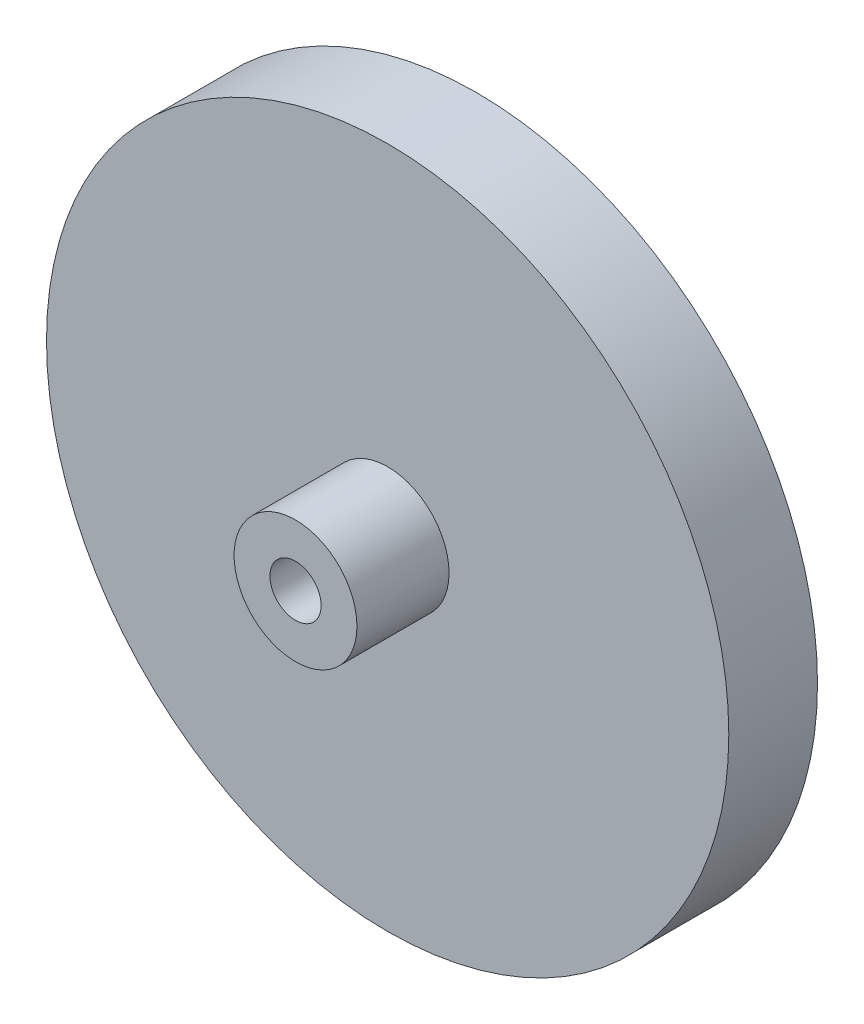
ISO-10303-21;
HEADER;
FILE_DESCRIPTION(('STEP AP214'),'2;1');
FILE_NAME('part.step','',(''),(''),'','','');
FILE_SCHEMA(('AUTOMOTIVE_DESIGN { 1 0 10303 214 1 1 1 1 }'));
ENDSEC;
DATA;
#1=APPLICATION_CONTEXT('core data for automotive mechanical design processes');
#2=APPLICATION_PROTOCOL_DEFINITION('international standard','automotive_design',2000,#1);
#3=PRODUCT_CONTEXT('',#1,'mechanical');
#4=PRODUCT('Part','Part','',(#3));
#5=PRODUCT_RELATED_PRODUCT_CATEGORY('part','',(#4));
#6=PRODUCT_DEFINITION_FORMATION('','',#4);
#7=PRODUCT_DEFINITION_CONTEXT('part definition',#1,'design');
#8=PRODUCT_DEFINITION('design','',#6,#7);
#9=PRODUCT_DEFINITION_SHAPE('','',#8);
#10=(LENGTH_UNIT() NAMED_UNIT(*) SI_UNIT(.MILLI.,.METRE.));
#11=(NAMED_UNIT(*) PLANE_ANGLE_UNIT() SI_UNIT($,.RADIAN.));
#12=(NAMED_UNIT(*) SI_UNIT($,.STERADIAN.) SOLID_ANGLE_UNIT());
#13=UNCERTAINTY_MEASURE_WITH_UNIT(LENGTH_MEASURE(1.E-05),#10,'distance_accuracy_value','');
#14=(GEOMETRIC_REPRESENTATION_CONTEXT(3) GLOBAL_UNCERTAINTY_ASSIGNED_CONTEXT((#13)) GLOBAL_UNIT_ASSIGNED_CONTEXT((#10,
#11,#12)) REPRESENTATION_CONTEXT('',''));
#15=CARTESIAN_POINT('',(0.,0.,0.));
#16=DIRECTION('',(0.,0.,1.));
#17=DIRECTION('',(1.,0.,0.));
#18=AXIS2_PLACEMENT_3D('',#15,#16,#17);
#19=CARTESIAN_POINT('',(0.,0.,3.25));
#20=DIRECTION('',(0.,0.,-1.));
#21=DIRECTION('',(-1.,0.,0.));
#22=AXIS2_PLACEMENT_3D('',#19,#20,#21);
#23=CYLINDRICAL_SURFACE('',#22,25.);
#24=CARTESIAN_POINT('',(0.,0.,3.25));
#25=DIRECTION('',(0.,0.,1.));
#26=DIRECTION('',(1.,0.,0.));
#27=AXIS2_PLACEMENT_3D('',#24,#25,#26);
#28=CIRCLE('',#27,25.);
#29=CARTESIAN_POINT('',(25.,0.,3.25));
#30=VERTEX_POINT('',#29);
#31=EDGE_CURVE('E44',#30,#30,#28,.T.);
#32=ORIENTED_EDGE('',*,*,#31,.F.);
#33=EDGE_LOOP('',(#32));
#34=FACE_BOUND('',#33,.T.);
#35=CARTESIAN_POINT('',(0.,0.,-3.25));
#36=DIRECTION('',(0.,0.,1.));
#37=DIRECTION('',(1.,0.,0.));
#38=AXIS2_PLACEMENT_3D('',#35,#36,#37);
#39=CIRCLE('',#38,25.);
#40=CARTESIAN_POINT('',(25.,0.,-3.25));
#41=VERTEX_POINT('',#40);
#42=EDGE_CURVE('E50',#41,#41,#39,.T.);
#43=ORIENTED_EDGE('',*,*,#42,.T.);
#44=EDGE_LOOP('',(#43));
#45=FACE_BOUND('',#44,.T.);
#46=ADVANCED_FACE('F36',(#34,#45),#23,.T.);
#47=CARTESIAN_POINT('',(0.,0.,3.25));
#48=DIRECTION('',(0.,0.,1.));
#49=DIRECTION('',(1.,0.,0.));
#50=AXIS2_PLACEMENT_3D('',#47,#48,#49);
#51=PLANE('',#50);
#52=CARTESIAN_POINT('',(0.,0.,3.25));
#53=DIRECTION('',(0.,0.,1.));
#54=DIRECTION('',(1.,0.,0.));
#55=AXIS2_PLACEMENT_3D('',#52,#53,#54);
#56=CIRCLE('',#55,4.5);
#57=CARTESIAN_POINT('',(4.5,0.,3.25));
#58=VERTEX_POINT('',#57);
#59=EDGE_CURVE('E59',#58,#58,#56,.F.);
#60=ORIENTED_EDGE('',*,*,#59,.T.);
#61=EDGE_LOOP('',(#60));
#62=FACE_BOUND('',#61,.T.);
#63=ORIENTED_EDGE('',*,*,#31,.T.);
#64=EDGE_LOOP('',(#63));
#65=FACE_BOUND('',#64,.T.);
#66=ADVANCED_FACE('F67',(#62,#65),#51,.T.);
#67=CARTESIAN_POINT('',(0.,0.,-3.25));
#68=DIRECTION('',(0.,0.,1.));
#69=DIRECTION('',(1.,0.,0.));
#70=AXIS2_PLACEMENT_3D('',#67,#68,#69);
#71=PLANE('',#70);
#72=CARTESIAN_POINT('',(0.,0.,-3.25));
#73=DIRECTION('',(0.,0.,-1.));
#74=DIRECTION('',(-1.,0.,0.));
#75=AXIS2_PLACEMENT_3D('',#72,#73,#74);
#76=CIRCLE('',#75,4.5);
#77=CARTESIAN_POINT('',(-4.5,0.,-3.25));
#78=VERTEX_POINT('',#77);
#79=EDGE_CURVE('E10',#78,#78,#76,.T.);
#80=ORIENTED_EDGE('',*,*,#79,.F.);
#81=EDGE_LOOP('',(#80));
#82=FACE_BOUND('',#81,.T.);
#83=ORIENTED_EDGE('',*,*,#42,.F.);
#84=EDGE_LOOP('',(#83));
#85=FACE_BOUND('',#84,.T.);
#86=ADVANCED_FACE('F74',(#82,#85),#71,.F.);
#87=CARTESIAN_POINT('',(0.,0.,10.));
#88=DIRECTION('',(0.,0.,-1.));
#89=DIRECTION('',(-1.,0.,0.));
#90=AXIS2_PLACEMENT_3D('',#87,#88,#89);
#91=CYLINDRICAL_SURFACE('',#90,4.5);
#92=ORIENTED_EDGE('',*,*,#59,.F.);
#93=EDGE_LOOP('',(#92));
#94=FACE_BOUND('',#93,.T.);
#95=CARTESIAN_POINT('',(0.,0.,10.));
#96=DIRECTION('',(0.,0.,1.));
#97=DIRECTION('',(1.,0.,0.));
#98=AXIS2_PLACEMENT_3D('',#95,#96,#97);
#99=CIRCLE('',#98,4.5);
#100=CARTESIAN_POINT('',(4.5,0.,10.));
#101=VERTEX_POINT('',#100);
#102=EDGE_CURVE('E56',#101,#101,#99,.T.);
#103=ORIENTED_EDGE('',*,*,#102,.F.);
#104=EDGE_LOOP('',(#103));
#105=FACE_BOUND('',#104,.T.);
#106=ADVANCED_FACE('F70',(#94,#105),#91,.T.);
#107=CARTESIAN_POINT('',(0.,0.,10.));
#108=DIRECTION('',(0.,0.,1.));
#109=DIRECTION('',(1.,0.,0.));
#110=AXIS2_PLACEMENT_3D('',#107,#108,#109);
#111=PLANE('',#110);
#112=CARTESIAN_POINT('',(0.,0.,10.));
#113=DIRECTION('',(0.,0.,1.));
#114=DIRECTION('',(1.,0.,0.));
#115=AXIS2_PLACEMENT_3D('',#112,#113,#114);
#116=CIRCLE('',#115,1.875);
#117=CARTESIAN_POINT('',(1.875,0.,10.));
#118=VERTEX_POINT('',#117);
#119=EDGE_CURVE('E156',#118,#118,#116,.T.);
#120=ORIENTED_EDGE('',*,*,#119,.F.);
#121=EDGE_LOOP('',(#120));
#122=FACE_BOUND('',#121,.T.);
#123=ORIENTED_EDGE('',*,*,#102,.T.);
#124=EDGE_LOOP('',(#123));
#125=FACE_BOUND('',#124,.T.);
#126=ADVANCED_FACE('F73',(#122,#125),#111,.T.);
#127=CARTESIAN_POINT('',(0.,0.,-8.25));
#128=DIRECTION('',(0.,0.,1.));
#129=DIRECTION('',(1.,0.,0.));
#130=AXIS2_PLACEMENT_3D('',#127,#128,#129);
#131=CYLINDRICAL_SURFACE('',#130,4.5);
#132=CARTESIAN_POINT('',(0.,0.,-8.25));
#133=DIRECTION('',(0.,0.,-1.));
#134=DIRECTION('',(-1.,0.,0.));
#135=AXIS2_PLACEMENT_3D('',#132,#133,#134);
#136=CIRCLE('',#135,4.5);
#137=CARTESIAN_POINT('',(-4.5,0.,-8.25));
#138=VERTEX_POINT('',#137);
#139=EDGE_CURVE('E54',#138,#138,#136,.T.);
#140=ORIENTED_EDGE('',*,*,#139,.F.);
#141=EDGE_LOOP('',(#140));
#142=FACE_BOUND('',#141,.T.);
#143=ORIENTED_EDGE('',*,*,#79,.T.);
#144=EDGE_LOOP('',(#143));
#145=FACE_BOUND('',#144,.T.);
#146=ADVANCED_FACE('F79',(#142,#145),#131,.T.);
#147=CARTESIAN_POINT('',(0.,0.,-8.25));
#148=DIRECTION('',(0.,0.,-1.));
#149=DIRECTION('',(-1.,0.,0.));
#150=AXIS2_PLACEMENT_3D('',#147,#148,#149);
#151=PLANE('',#150);
#152=CARTESIAN_POINT('',(0.,0.,-8.25));
#153=DIRECTION('',(0.,0.,-1.));
#154=DIRECTION('',(-1.,0.,0.));
#155=AXIS2_PLACEMENT_3D('',#152,#153,#154);
#156=CIRCLE('',#155,3.1);
#157=CARTESIAN_POINT('',(-3.1,0.,-8.25));
#158=VERTEX_POINT('',#157);
#159=EDGE_CURVE('E161',#158,#158,#156,.T.);
#160=ORIENTED_EDGE('',*,*,#159,.F.);
#161=EDGE_LOOP('',(#160));
#162=FACE_BOUND('',#161,.T.);
#163=ORIENTED_EDGE('',*,*,#139,.T.);
#164=EDGE_LOOP('',(#163));
#165=FACE_BOUND('',#164,.T.);
#166=ADVANCED_FACE('F87',(#162,#165),#151,.T.);
#167=CARTESIAN_POINT('',(0.,0.,-5.75));
#168=DIRECTION('',(0.,0.,-1.));
#169=DIRECTION('',(-1.,0.,0.));
#170=AXIS2_PLACEMENT_3D('',#167,#168,#169);
#171=CYLINDRICAL_SURFACE('',#170,3.1);
#172=CARTESIAN_POINT('',(0.,0.,-5.75));
#173=DIRECTION('',(0.,0.,-1.));
#174=DIRECTION('',(-1.,0.,0.));
#175=AXIS2_PLACEMENT_3D('',#172,#173,#174);
#176=CIRCLE('',#175,3.1);
#177=CARTESIAN_POINT('',(-3.1,0.,-5.75));
#178=VERTEX_POINT('',#177);
#179=EDGE_CURVE('E165',#178,#178,#176,.T.);
#180=ORIENTED_EDGE('',*,*,#179,.F.);
#181=EDGE_LOOP('',(#180));
#182=FACE_BOUND('',#181,.T.);
#183=ORIENTED_EDGE('',*,*,#159,.T.);
#184=EDGE_LOOP('',(#183));
#185=FACE_BOUND('',#184,.T.);
#186=ADVANCED_FACE('F125',(#182,#185),#171,.F.);
#187=CARTESIAN_POINT('',(0.,0.,-5.75));
#188=DIRECTION('',(0.,0.,-1.));
#189=DIRECTION('',(-1.,0.,0.));
#190=AXIS2_PLACEMENT_3D('',#187,#188,#189);
#191=PLANE('',#190);
#192=CARTESIAN_POINT('',(0.,0.,-5.75));
#193=DIRECTION('',(0.,0.,-1.));
#194=DIRECTION('',(-1.,0.,0.));
#195=AXIS2_PLACEMENT_3D('',#192,#193,#194);
#196=CIRCLE('',#195,1.875);
#197=CARTESIAN_POINT('',(-1.875,0.,-5.75));
#198=VERTEX_POINT('',#197);
#199=EDGE_CURVE('E39',#198,#198,#196,.T.);
#200=ORIENTED_EDGE('',*,*,#199,.F.);
#201=EDGE_LOOP('',(#200));
#202=FACE_BOUND('',#201,.T.);
#203=ORIENTED_EDGE('',*,*,#179,.T.);
#204=EDGE_LOOP('',(#203));
#205=FACE_BOUND('',#204,.T.);
#206=ADVANCED_FACE('F132',(#202,#205),#191,.T.);
#207=CARTESIAN_POINT('',(0.,0.,-8.25));
#208=DIRECTION('',(0.,0.,1.));
#209=DIRECTION('',(1.,0.,0.));
#210=AXIS2_PLACEMENT_3D('',#207,#208,#209);
#211=CYLINDRICAL_SURFACE('',#210,1.875);
#212=ORIENTED_EDGE('',*,*,#119,.T.);
#213=EDGE_LOOP('',(#212));
#214=FACE_BOUND('',#213,.T.);
#215=ORIENTED_EDGE('',*,*,#199,.T.);
#216=EDGE_LOOP('',(#215));
#217=FACE_BOUND('',#216,.T.);
#218=ADVANCED_FACE('F140',(#214,#217),#211,.F.);
#219=CLOSED_SHELL('',(#46,#66,#86,#106,#126,#146,#166,#186,#206,#218));
#220=MANIFOLD_SOLID_BREP('B2',#219);
#221=ADVANCED_BREP_SHAPE_REPRESENTATION('',(#18,#220),#14);
#222=SHAPE_DEFINITION_REPRESENTATION(#9,#221);
ENDSEC;
END-ISO-10303-21;
